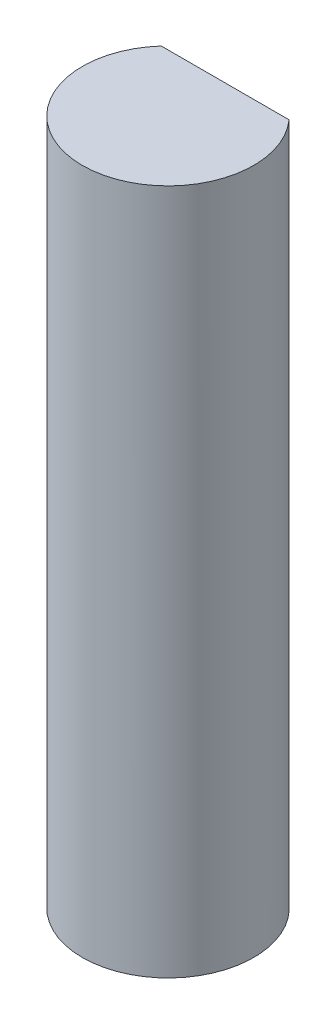
ISO-10303-21;
HEADER;
FILE_DESCRIPTION(('STEP AP214'),'2;1');
FILE_NAME('part.step','',(''),(''),'','','');
FILE_SCHEMA(('AUTOMOTIVE_DESIGN { 1 0 10303 214 1 1 1 1 }'));
ENDSEC;
DATA;
#1=APPLICATION_CONTEXT('core data for automotive mechanical design processes');
#2=APPLICATION_PROTOCOL_DEFINITION('international standard','automotive_design',2000,#1);
#3=PRODUCT_CONTEXT('',#1,'mechanical');
#4=PRODUCT('Part','Part','',(#3));
#5=PRODUCT_RELATED_PRODUCT_CATEGORY('part','',(#4));
#6=PRODUCT_DEFINITION_FORMATION('','',#4);
#7=PRODUCT_DEFINITION_CONTEXT('part definition',#1,'design');
#8=PRODUCT_DEFINITION('design','',#6,#7);
#9=PRODUCT_DEFINITION_SHAPE('','',#8);
#10=(LENGTH_UNIT() NAMED_UNIT(*) SI_UNIT(.MILLI.,.METRE.));
#11=(NAMED_UNIT(*) PLANE_ANGLE_UNIT() SI_UNIT($,.RADIAN.));
#12=(NAMED_UNIT(*) SI_UNIT($,.STERADIAN.) SOLID_ANGLE_UNIT());
#13=UNCERTAINTY_MEASURE_WITH_UNIT(LENGTH_MEASURE(1.E-05),#10,'distance_accuracy_value','');
#14=(GEOMETRIC_REPRESENTATION_CONTEXT(3) GLOBAL_UNCERTAINTY_ASSIGNED_CONTEXT((#13)) GLOBAL_UNIT_ASSIGNED_CONTEXT((#10,
#11,#12)) REPRESENTATION_CONTEXT('',''));
#15=CARTESIAN_POINT('',(0.,0.,0.));
#16=DIRECTION('',(0.,0.,1.));
#17=DIRECTION('',(1.,0.,0.));
#18=AXIS2_PLACEMENT_3D('',#15,#16,#17);
#19=CARTESIAN_POINT('',(0.,10.,0.));
#20=DIRECTION('',(0.,-1.,0.));
#21=DIRECTION('',(0.,0.,-1.));
#22=AXIS2_PLACEMENT_3D('',#19,#20,#21);
#23=CYLINDRICAL_SURFACE('',#22,1.5);
#24=CARTESIAN_POINT('',(0.,10.,0.));
#25=DIRECTION('',(0.,1.,0.));
#26=DIRECTION('',(0.,0.,1.));
#27=AXIS2_PLACEMENT_3D('',#24,#25,#26);
#28=CIRCLE('',#27,1.5);
#29=CARTESIAN_POINT('',(-1.1180339887499,10.,-1.));
#30=VERTEX_POINT('',#29);
#31=CARTESIAN_POINT('',(1.1180339887499,10.,-1.));
#32=VERTEX_POINT('',#31);
#33=EDGE_CURVE('E11',#30,#32,#28,.T.);
#34=ORIENTED_EDGE('',*,*,#33,.F.);
#35=DIRECTION('',(0.,1.,0.));
#36=VECTOR('',#35,1.);
#37=CARTESIAN_POINT('',(-1.1180339887499,0.,-1.));
#38=LINE('',#37,#36);
#39=CARTESIAN_POINT('',(-1.1180339887499,0.,-1.));
#40=VERTEX_POINT('',#39);
#41=EDGE_CURVE('E57',#40,#30,#38,.T.);
#42=ORIENTED_EDGE('',*,*,#41,.F.);
#43=CARTESIAN_POINT('',(0.,0.,0.));
#44=DIRECTION('',(0.,-1.,0.));
#45=DIRECTION('',(0.,0.,-1.));
#46=AXIS2_PLACEMENT_3D('',#43,#44,#45);
#47=CIRCLE('',#46,1.5);
#48=CARTESIAN_POINT('',(1.1180339887499,0.,-1.));
#49=VERTEX_POINT('',#48);
#50=EDGE_CURVE('E69',#40,#49,#47,.T.);
#51=ORIENTED_EDGE('',*,*,#50,.T.);
#52=DIRECTION('',(0.,1.,0.));
#53=VECTOR('',#52,1.);
#54=CARTESIAN_POINT('',(1.1180339887499,0.,-1.));
#55=LINE('',#54,#53);
#56=EDGE_CURVE('E43',#49,#32,#55,.T.);
#57=ORIENTED_EDGE('',*,*,#56,.T.);
#58=EDGE_LOOP('',(#34,#42,#51,#57));
#59=FACE_BOUND('',#58,.T.);
#60=CARTESIAN_POINT('',(0.,-2.,0.));
#61=DIRECTION('',(0.,-1.,0.));
#62=DIRECTION('',(0.,0.,-1.));
#63=AXIS2_PLACEMENT_3D('',#60,#61,#62);
#64=CIRCLE('',#63,1.5);
#65=CARTESIAN_POINT('',(0.,-2.,-1.5));
#66=VERTEX_POINT('',#65);
#67=EDGE_CURVE('E72',#66,#66,#64,.T.);
#68=ORIENTED_EDGE('',*,*,#67,.F.);
#69=EDGE_LOOP('',(#68));
#70=FACE_BOUND('',#69,.T.);
#71=ADVANCED_FACE('F34',(#59,#70),#23,.T.);
#72=CARTESIAN_POINT('',(0.,10.,0.));
#73=DIRECTION('',(0.,1.,0.));
#74=DIRECTION('',(0.,0.,1.));
#75=AXIS2_PLACEMENT_3D('',#72,#73,#74);
#76=PLANE('',#75);
#77=DIRECTION('',(1.,0.,0.));
#78=VECTOR('',#77,1.);
#79=CARTESIAN_POINT('',(-1.1180339887499,10.,-1.));
#80=LINE('',#79,#78);
#81=EDGE_CURVE('E61',#30,#32,#80,.T.);
#82=ORIENTED_EDGE('',*,*,#81,.F.);
#83=ORIENTED_EDGE('',*,*,#33,.T.);
#84=EDGE_LOOP('',(#82,#83));
#85=FACE_BOUND('',#84,.T.);
#86=ADVANCED_FACE('F87',(#85),#76,.T.);
#87=CARTESIAN_POINT('',(-1.1180339887499,0.,-1.));
#88=DIRECTION('',(0.,0.,1.));
#89=DIRECTION('',(1.,0.,0.));
#90=AXIS2_PLACEMENT_3D('',#87,#88,#89);
#91=PLANE('',#90);
#92=ORIENTED_EDGE('',*,*,#81,.T.);
#93=ORIENTED_EDGE('',*,*,#56,.F.);
#94=DIRECTION('',(1.,0.,0.));
#95=VECTOR('',#94,1.);
#96=CARTESIAN_POINT('',(-1.1180339887499,0.,-1.));
#97=LINE('',#96,#95);
#98=EDGE_CURVE('E51',#40,#49,#97,.T.);
#99=ORIENTED_EDGE('',*,*,#98,.F.);
#100=ORIENTED_EDGE('',*,*,#41,.T.);
#101=EDGE_LOOP('',(#92,#93,#99,#100));
#102=FACE_BOUND('',#101,.T.);
#103=ADVANCED_FACE('F60',(#102),#91,.F.);
#104=CARTESIAN_POINT('',(0.,0.,0.));
#105=DIRECTION('',(0.,-1.,0.));
#106=DIRECTION('',(0.,0.,-1.));
#107=AXIS2_PLACEMENT_3D('',#104,#105,#106);
#108=PLANE('',#107);
#109=ORIENTED_EDGE('',*,*,#50,.F.);
#110=ORIENTED_EDGE('',*,*,#98,.T.);
#111=EDGE_LOOP('',(#109,#110));
#112=FACE_BOUND('',#111,.T.);
#113=ADVANCED_FACE('F68',(#112),#108,.F.);
#114=CARTESIAN_POINT('',(0.,-2.,0.));
#115=DIRECTION('',(0.,-1.,0.));
#116=DIRECTION('',(0.,0.,-1.));
#117=AXIS2_PLACEMENT_3D('',#114,#115,#116);
#118=PLANE('',#117);
#119=ORIENTED_EDGE('',*,*,#67,.T.);
#120=EDGE_LOOP('',(#119));
#121=FACE_BOUND('',#120,.T.);
#122=ADVANCED_FACE('F85',(#121),#118,.T.);
#123=CLOSED_SHELL('',(#71,#86,#103,#113,#122));
#124=MANIFOLD_SOLID_BREP('B2',#123);
#125=ADVANCED_BREP_SHAPE_REPRESENTATION('',(#18,#124),#14);
#126=SHAPE_DEFINITION_REPRESENTATION(#9,#125);
ENDSEC;
END-ISO-10303-21;
